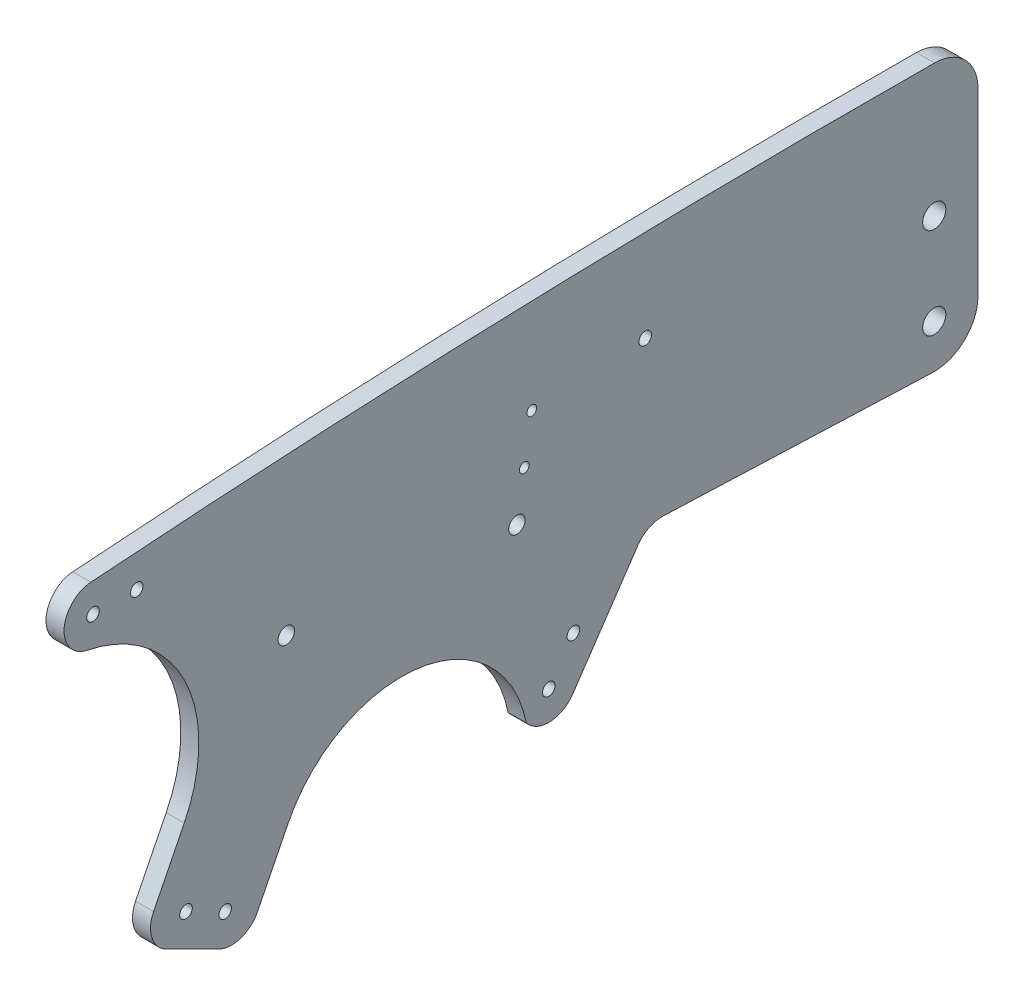
ISO-10303-21;
HEADER;
FILE_DESCRIPTION(('STEP AP214'),'2;1');
FILE_NAME('part.step','',(''),(''),'','','');
FILE_SCHEMA(('AUTOMOTIVE_DESIGN { 1 0 10303 214 1 1 1 1 }'));
ENDSEC;
DATA;
#1=APPLICATION_CONTEXT('core data for automotive mechanical design processes');
#2=APPLICATION_PROTOCOL_DEFINITION('international standard','automotive_design',2000,#1);
#3=PRODUCT_CONTEXT('',#1,'mechanical');
#4=PRODUCT('Part','Part','',(#3));
#5=PRODUCT_RELATED_PRODUCT_CATEGORY('part','',(#4));
#6=PRODUCT_DEFINITION_FORMATION('','',#4);
#7=PRODUCT_DEFINITION_CONTEXT('part definition',#1,'design');
#8=PRODUCT_DEFINITION('design','',#6,#7);
#9=PRODUCT_DEFINITION_SHAPE('','',#8);
#10=(LENGTH_UNIT() NAMED_UNIT(*) SI_UNIT(.MILLI.,.METRE.));
#11=(NAMED_UNIT(*) PLANE_ANGLE_UNIT() SI_UNIT($,.RADIAN.));
#12=(NAMED_UNIT(*) SI_UNIT($,.STERADIAN.) SOLID_ANGLE_UNIT());
#13=UNCERTAINTY_MEASURE_WITH_UNIT(LENGTH_MEASURE(1.E-05),#10,'distance_accuracy_value','');
#14=(GEOMETRIC_REPRESENTATION_CONTEXT(3) GLOBAL_UNCERTAINTY_ASSIGNED_CONTEXT((#13)) GLOBAL_UNIT_ASSIGNED_CONTEXT((#10,
#11,#12)) REPRESENTATION_CONTEXT('',''));
#15=CARTESIAN_POINT('',(0.,0.,0.));
#16=DIRECTION('',(0.,0.,1.));
#17=DIRECTION('',(1.,0.,0.));
#18=AXIS2_PLACEMENT_3D('',#15,#16,#17);
#19=CARTESIAN_POINT('',(4.953,-32.7611872371542,354.680554334521));
#20=DIRECTION('',(1.,0.,0.));
#21=DIRECTION('',(0.,0.,-1.));
#22=AXIS2_PLACEMENT_3D('',#19,#20,#21);
#23=PLANE('',#22);
#24=CARTESIAN_POINT('',(4.953,-53.2898683118976,485.252549027286));
#25=DIRECTION('',(1.,0.,0.));
#26=DIRECTION('',(0.,0.,-1.));
#27=AXIS2_PLACEMENT_3D('',#24,#25,#26);
#28=CIRCLE('',#27,1.72719999999997);
#29=CARTESIAN_POINT('',(4.953,-53.2898683118976,483.525349027286));
#30=VERTEX_POINT('',#29);
#31=EDGE_CURVE('E300',#30,#30,#28,.T.);
#32=ORIENTED_EDGE('',*,*,#31,.F.);
#33=EDGE_LOOP('',(#32));
#34=FACE_BOUND('',#33,.T.);
#35=CARTESIAN_POINT('',(4.953,29.9682270325283,498.771367049348));
#36=DIRECTION('',(1.,0.,0.));
#37=DIRECTION('',(0.,0.,-1.));
#38=AXIS2_PLACEMENT_3D('',#35,#36,#37);
#39=CIRCLE('',#38,1.72719999999997);
#40=CARTESIAN_POINT('',(4.953,29.9682270325283,497.044167049348));
#41=VERTEX_POINT('',#40);
#42=EDGE_CURVE('E294',#41,#41,#39,.T.);
#43=ORIENTED_EDGE('',*,*,#42,.F.);
#44=EDGE_LOOP('',(#43));
#45=FACE_BOUND('',#44,.T.);
#46=CARTESIAN_POINT('',(4.953,-40.2511356494511,379.006254083328));
#47=DIRECTION('',(1.,0.,0.));
#48=DIRECTION('',(0.,0.,-1.));
#49=AXIS2_PLACEMENT_3D('',#46,#47,#48);
#50=CIRCLE('',#49,1.72719999999999);
#51=CARTESIAN_POINT('',(4.953,-40.2511356494511,377.279054083328));
#52=VERTEX_POINT('',#51);
#53=EDGE_CURVE('E288',#52,#52,#50,.T.);
#54=ORIENTED_EDGE('',*,*,#53,.F.);
#55=EDGE_LOOP('',(#54));
#56=FACE_BOUND('',#55,.T.);
#57=CARTESIAN_POINT('',(4.953,-50.185658720557,385.737171654481));
#58=DIRECTION('',(1.,0.,0.));
#59=DIRECTION('',(0.,0.,-1.));
#60=AXIS2_PLACEMENT_3D('',#57,#58,#59);
#61=CIRCLE('',#60,1.72719999999997);
#62=CARTESIAN_POINT('',(4.953,-50.185658720557,384.009971654481));
#63=VERTEX_POINT('',#62);
#64=EDGE_CURVE('E282',#63,#63,#61,.T.);
#65=ORIENTED_EDGE('',*,*,#64,.F.);
#66=EDGE_LOOP('',(#65));
#67=FACE_BOUND('',#66,.T.);
#68=CARTESIAN_POINT('',(4.953,18.3061282263118,390.419716853028));
#69=DIRECTION('',(1.,0.,0.));
#70=DIRECTION('',(0.,0.,-1.));
#71=AXIS2_PLACEMENT_3D('',#68,#69,#70);
#72=CIRCLE('',#71,1.35255002158136);
#73=CARTESIAN_POINT('',(4.953,18.3061282263118,389.067166831447));
#74=VERTEX_POINT('',#73);
#75=EDGE_CURVE('E276',#74,#74,#72,.T.);
#76=ORIENTED_EDGE('',*,*,#75,.F.);
#77=EDGE_LOOP('',(#76));
#78=FACE_BOUND('',#77,.T.);
#79=CARTESIAN_POINT('',(4.953,-6.76719297354006,394.480328138154));
#80=DIRECTION('',(1.,0.,0.));
#81=DIRECTION('',(0.,0.,-1.));
#82=AXIS2_PLACEMENT_3D('',#79,#80,#81);
#83=CIRCLE('',#82,2.25424999999999);
#84=CARTESIAN_POINT('',(4.953,-6.76719297354006,392.226078138154));
#85=VERTEX_POINT('',#84);
#86=EDGE_CURVE('E210',#85,#85,#83,.T.);
#87=ORIENTED_EDGE('',*,*,#86,.F.);
#88=EDGE_LOOP('',(#87));
#89=FACE_BOUND('',#88,.T.);
#90=CARTESIAN_POINT('',(4.953,-32.7611872371542,354.680554334521));
#91=DIRECTION('',(-1.,0.,0.));
#92=DIRECTION('',(0.,0.,-1.));
#93=AXIS2_PLACEMENT_3D('',#90,#91,#92);
#94=CIRCLE('',#93,7.99999999999897);
#95=CARTESIAN_POINT('',(4.953,-28.2739088563857,361.303569715256));
#96=VERTEX_POINT('',#95);
#97=CARTESIAN_POINT('',(4.953,-24.7672215054673,354.369890721241));
#98=VERTEX_POINT('',#97);
#99=EDGE_CURVE('E211',#96,#98,#94,.T.);
#100=ORIENTED_EDGE('',*,*,#99,.T.);
#101=DIRECTION('',(0.,-0.0388329516596951,-0.999245716460869));
#102=VECTOR('',#101,1.);
#103=CARTESIAN_POINT('',(4.953,-24.7672215054673,354.369890721241));
#104=LINE('',#103,#102);
#105=CARTESIAN_POINT('',(4.953,-27.639294256366,280.465995419916));
#106=VERTEX_POINT('',#105);
#107=EDGE_CURVE('E122',#98,#106,#104,.T.);
#108=ORIENTED_EDGE('',*,*,#107,.T.);
#109=CARTESIAN_POINT('',(4.953,-15.6483456588356,280.));
#110=DIRECTION('',(1.,0.,0.));
#111=DIRECTION('',(0.,0.,1.));
#112=AXIS2_PLACEMENT_3D('',#109,#110,#111);
#113=CIRCLE('',#112,12.);
#114=CARTESIAN_POINT('',(4.953,-15.6483456588356,268.));
#115=VERTEX_POINT('',#114);
#116=EDGE_CURVE('E225',#106,#115,#113,.T.);
#117=ORIENTED_EDGE('',*,*,#116,.T.);
#118=DIRECTION('',(0.,1.,0.));
#119=VECTOR('',#118,1.);
#120=CARTESIAN_POINT('',(4.953,33.6380456938623,268.));
#121=LINE('',#120,#119);
#122=CARTESIAN_POINT('',(4.953,33.6380456938623,268.));
#123=VERTEX_POINT('',#122);
#124=EDGE_CURVE('E228',#115,#123,#121,.T.);
#125=ORIENTED_EDGE('',*,*,#124,.T.);
#126=CARTESIAN_POINT('',(4.953,33.6380456938623,280.));
#127=DIRECTION('',(1.,0.,0.));
#128=DIRECTION('',(0.,0.,-1.));
#129=AXIS2_PLACEMENT_3D('',#126,#127,#128);
#130=CIRCLE('',#129,12.0000000000002);
#131=CARTESIAN_POINT('',(4.953,45.6376789125345,279.906177735357));
#132=VERTEX_POINT('',#131);
#133=EDGE_CURVE('E232',#123,#132,#130,.T.);
#134=ORIENTED_EDGE('',*,*,#133,.T.);
#135=CARTESIAN_POINT('',(4.953,-2797.93492372453,302.139392400577));
#136=DIRECTION('',(1.,0.,0.));
#137=DIRECTION('',(0.,0.,1.));
#138=AXIS2_PLACEMENT_3D('',#135,#136,#137);
#139=CIRCLE('',#138,2843.65951940497);
#140=CARTESIAN_POINT('',(4.953,38.0179068856692,511.354604219596));
#141=VERTEX_POINT('',#140);
#142=EDGE_CURVE('E236',#132,#141,#139,.T.);
#143=ORIENTED_EDGE('',*,*,#142,.T.);
#144=CARTESIAN_POINT('',(4.953,30.1019185476259,510.770622300354));
#145=DIRECTION('',(1.,0.,0.));
#146=DIRECTION('',(0.,0.,-1.));
#147=AXIS2_PLACEMENT_3D('',#144,#145,#146);
#148=CIRCLE('',#147,7.93750000000252);
#149=CARTESIAN_POINT('',(4.953,22.31826474198,512.325819935349));
#150=VERTEX_POINT('',#149);
#151=EDGE_CURVE('E244',#141,#150,#148,.T.);
#152=ORIENTED_EDGE('',*,*,#151,.T.);
#153=CARTESIAN_POINT('',(4.953,-15.0065003575197,519.783421192923));
#154=DIRECTION('',(-1.,0.,0.));
#155=DIRECTION('',(0.,0.,-1.));
#156=AXIS2_PLACEMENT_3D('',#153,#154,#155);
#157=CIRCLE('',#156,38.0624999999975);
#158=CARTESIAN_POINT('',(4.953,-32.0249578675477,485.73748149038));
#159=VERTEX_POINT('',#158);
#160=EDGE_CURVE('E247',#150,#159,#157,.T.);
#161=ORIENTED_EDGE('',*,*,#160,.T.);
#162=DIRECTION('',(0.,-0.894474606306604,0.447118752316033));
#163=VECTOR('',#162,1.);
#164=CARTESIAN_POINT('',(4.953,-32.0249578675479,485.73748149038));
#165=LINE('',#164,#163);
#166=CARTESIAN_POINT('',(4.953,-48.8447478119963,494.145147220805));
#167=VERTEX_POINT('',#166);
#168=EDGE_CURVE('E251',#159,#167,#165,.T.);
#169=ORIENTED_EDGE('',*,*,#168,.T.);
#170=CARTESIAN_POINT('',(4.953,-52.4216978305244,486.989350370353));
#171=DIRECTION('',(1.,0.,0.));
#172=DIRECTION('',(0.,0.,-1.));
#173=AXIS2_PLACEMENT_3D('',#170,#171,#172);
#174=CIRCLE('',#173,7.99999999999946);
#175=CARTESIAN_POINT('',(4.953,-59.5774946809771,490.566300388881));
#176=VERTEX_POINT('',#175);
#177=EDGE_CURVE('E255',#167,#176,#174,.T.);
#178=ORIENTED_EDGE('',*,*,#177,.T.);
#179=DIRECTION('',(0.,-0.447118752316036,-0.894474606306602));
#180=VECTOR('',#179,1.);
#181=CARTESIAN_POINT('',(4.953,-59.5774946809774,490.566300388881));
#182=LINE('',#181,#180);
#183=CARTESIAN_POINT('',(4.953,-66.6792606715157,476.359002427067));
#184=VERTEX_POINT('',#183);
#185=EDGE_CURVE('E262',#176,#184,#182,.T.);
#186=ORIENTED_EDGE('',*,*,#185,.T.);
#187=CARTESIAN_POINT('',(4.953,-59.5234638210631,472.782052408539));
#188=DIRECTION('',(1.,0.,0.));
#189=DIRECTION('',(0.,0.,-1.));
#190=AXIS2_PLACEMENT_3D('',#187,#188,#189);
#191=CIRCLE('',#190,7.99999999999985);
#192=CARTESIAN_POINT('',(4.953,-63.1004138395911,465.626255558086));
#193=VERTEX_POINT('',#192);
#194=EDGE_CURVE('E265',#184,#193,#191,.T.);
#195=ORIENTED_EDGE('',*,*,#194,.T.);
#196=DIRECTION('',(0.,0.894474606306604,-0.447118752316034));
#197=VECTOR('',#196,1.);
#198=CARTESIAN_POINT('',(4.953,-63.1004138395911,465.626255558086));
#199=LINE('',#198,#197);
#200=CARTESIAN_POINT('',(4.953,-46.2806238951434,457.218589827661));
#201=VERTEX_POINT('',#200);
#202=EDGE_CURVE('E165',#193,#201,#199,.T.);
#203=ORIENTED_EDGE('',*,*,#202,.T.);
#204=CARTESIAN_POINT('',(4.953,-61.8421896626251,426.087206182307));
#205=DIRECTION('',(-1.,0.,0.));
#206=DIRECTION('',(0.,0.,-1.));
#207=AXIS2_PLACEMENT_3D('',#204,#205,#206);
#208=CIRCLE('',#207,34.8040999999982);
#209=CARTESIAN_POINT('',(4.953,-55.1468529615088,391.933175040016));
#210=VERTEX_POINT('',#209);
#211=EDGE_CURVE('E159',#201,#210,#208,.T.);
#212=ORIENTED_EDGE('',*,*,#211,.T.);
#213=CARTESIAN_POINT('',(4.953,-50.185658720557,385.737171654481));
#214=DIRECTION('',(1.,0.,0.));
#215=DIRECTION('',(0.,0.,-1.));
#216=AXIS2_PLACEMENT_3D('',#213,#214,#215);
#217=CIRCLE('',#216,7.93750000000079);
#218=CARTESIAN_POINT('',(4.953,-54.6378802389763,379.165898581405));
#219=VERTEX_POINT('',#218);
#220=EDGE_CURVE('E163',#210,#219,#217,.T.);
#221=ORIENTED_EDGE('',*,*,#220,.T.);
#222=DIRECTION('',(0.,0.827876922592201,-0.560909797596073));
#223=VECTOR('',#222,1.);
#224=CARTESIAN_POINT('',(4.953,-54.6378802389763,379.165898581405));
#225=LINE('',#224,#223);
#226=EDGE_CURVE('E55',#219,#96,#225,.T.);
#227=ORIENTED_EDGE('',*,*,#226,.T.);
#228=EDGE_LOOP('',(#100,#108,#117,#125,#134,#143,#152,#161,#169,#178,#186,#195,#203,#212,#221,#227));
#229=FACE_BOUND('',#228,.T.);
#230=CARTESIAN_POINT('',(4.953,-1.41718755012804,457.754552289623));
#231=DIRECTION('',(1.,0.,0.));
#232=DIRECTION('',(0.,0.,-1.));
#233=AXIS2_PLACEMENT_3D('',#230,#231,#232);
#234=CIRCLE('',#233,2.25424999999999);
#235=CARTESIAN_POINT('',(4.953,-1.41718755012804,455.500302289623));
#236=VERTEX_POINT('',#235);
#237=EDGE_CURVE('E198',#236,#236,#234,.T.);
#238=ORIENTED_EDGE('',*,*,#237,.F.);
#239=EDGE_LOOP('',(#238));
#240=FACE_BOUND('',#239,.T.);
#241=CARTESIAN_POINT('',(4.953,30.1019185476259,510.770622300354));
#242=DIRECTION('',(1.,0.,0.));
#243=DIRECTION('',(0.,0.,-1.));
#244=AXIS2_PLACEMENT_3D('',#241,#242,#243);
#245=CIRCLE('',#244,1.72720000000008);
#246=CARTESIAN_POINT('',(4.953,30.1019185476259,509.043422300354));
#247=VERTEX_POINT('',#246);
#248=EDGE_CURVE('E611',#247,#247,#245,.T.);
#249=ORIENTED_EDGE('',*,*,#248,.F.);
#250=EDGE_LOOP('',(#249));
#251=FACE_BOUND('',#250,.T.);
#252=CARTESIAN_POINT('',(4.953,5.76946762638475,392.450022495594));
#253=DIRECTION('',(1.,0.,0.));
#254=DIRECTION('',(0.,0.,-1.));
#255=AXIS2_PLACEMENT_3D('',#252,#253,#254);
#256=CIRCLE('',#255,1.35255002158135);
#257=CARTESIAN_POINT('',(4.953,5.76946762638475,391.097472474013));
#258=VERTEX_POINT('',#257);
#259=EDGE_CURVE('E610',#258,#258,#256,.T.);
#260=ORIENTED_EDGE('',*,*,#259,.F.);
#261=EDGE_LOOP('',(#260));
#262=FACE_BOUND('',#261,.T.);
#263=CARTESIAN_POINT('',(4.953,-15.6483456588356,280.));
#264=DIRECTION('',(1.,0.,0.));
#265=DIRECTION('',(0.,0.,-1.));
#266=AXIS2_PLACEMENT_3D('',#263,#264,#265);
#267=CIRCLE('',#266,3.17499999999997);
#268=CARTESIAN_POINT('',(4.953,-15.6483456588356,276.825));
#269=VERTEX_POINT('',#268);
#270=EDGE_CURVE('E599',#269,#269,#267,.T.);
#271=ORIENTED_EDGE('',*,*,#270,.F.);
#272=EDGE_LOOP('',(#271));
#273=FACE_BOUND('',#272,.T.);
#274=CARTESIAN_POINT('',(4.953,19.9282164771804,359.276554144292));
#275=DIRECTION('',(1.,0.,0.));
#276=DIRECTION('',(0.,0.,-1.));
#277=AXIS2_PLACEMENT_3D('',#274,#275,#276);
#278=CIRCLE('',#277,1.72719999999997);
#279=CARTESIAN_POINT('',(4.953,19.9282164771804,357.549354144292));
#280=VERTEX_POINT('',#279);
#281=EDGE_CURVE('E325',#280,#280,#278,.T.);
#282=ORIENTED_EDGE('',*,*,#281,.F.);
#283=EDGE_LOOP('',(#282));
#284=FACE_BOUND('',#283,.T.);
#285=CARTESIAN_POINT('',(4.953,-58.65529333969,474.518853751606));
#286=DIRECTION('',(1.,0.,0.));
#287=DIRECTION('',(0.,0.,-1.));
#288=AXIS2_PLACEMENT_3D('',#285,#286,#287);
#289=CIRCLE('',#288,1.72719999999997);
#290=CARTESIAN_POINT('',(4.953,-58.65529333969,472.791653751606));
#291=VERTEX_POINT('',#290);
#292=EDGE_CURVE('E308',#291,#291,#289,.T.);
#293=ORIENTED_EDGE('',*,*,#292,.F.);
#294=EDGE_LOOP('',(#293));
#295=FACE_BOUND('',#294,.T.);
#296=CARTESIAN_POINT('',(4.953,9.35165434116442,280.));
#297=DIRECTION('',(1.,0.,0.));
#298=DIRECTION('',(0.,0.,-1.));
#299=AXIS2_PLACEMENT_3D('',#296,#297,#298);
#300=CIRCLE('',#299,3.17499999999997);
#301=CARTESIAN_POINT('',(4.953,9.35165434116442,276.825));
#302=VERTEX_POINT('',#301);
#303=EDGE_CURVE('E311',#302,#302,#300,.T.);
#304=ORIENTED_EDGE('',*,*,#303,.F.);
#305=EDGE_LOOP('',(#304));
#306=FACE_BOUND('',#305,.T.);
#307=ADVANCED_FACE('F38',(#34,#45,#56,#67,#78,#89,#229,#240,#251,#262,#273,#284,#295,#306),#23,.T.);
#308=CARTESIAN_POINT('',(0.,-32.7611872371542,354.680554334521));
#309=DIRECTION('',(1.,0.,0.));
#310=DIRECTION('',(0.,0.,-1.));
#311=AXIS2_PLACEMENT_3D('',#308,#309,#310);
#312=PLANE('',#311);
#313=CARTESIAN_POINT('',(0.,-32.7611872371542,354.680554334521));
#314=DIRECTION('',(-1.,0.,0.));
#315=DIRECTION('',(0.,0.,-1.));
#316=AXIS2_PLACEMENT_3D('',#313,#314,#315);
#317=CIRCLE('',#316,7.99999999999897);
#318=CARTESIAN_POINT('',(0.,-28.2739088563857,361.303569715256));
#319=VERTEX_POINT('',#318);
#320=CARTESIAN_POINT('',(0.,-24.7672215054673,354.369890721241));
#321=VERTEX_POINT('',#320);
#322=EDGE_CURVE('E204',#319,#321,#317,.T.);
#323=ORIENTED_EDGE('',*,*,#322,.F.);
#324=DIRECTION('',(0.,0.827876922592201,-0.560909797596073));
#325=VECTOR('',#324,1.);
#326=CARTESIAN_POINT('',(0.,-54.6378802389763,379.165898581405));
#327=LINE('',#326,#325);
#328=CARTESIAN_POINT('',(0.,-54.6378802389763,379.165898581405));
#329=VERTEX_POINT('',#328);
#330=EDGE_CURVE('E114',#329,#319,#327,.T.);
#331=ORIENTED_EDGE('',*,*,#330,.F.);
#332=CARTESIAN_POINT('',(0.,-50.185658720557,385.737171654481));
#333=DIRECTION('',(1.,0.,0.));
#334=DIRECTION('',(0.,0.,-1.));
#335=AXIS2_PLACEMENT_3D('',#332,#333,#334);
#336=CIRCLE('',#335,7.93750000000079);
#337=CARTESIAN_POINT('',(0.,-55.1468529615088,391.933175040016));
#338=VERTEX_POINT('',#337);
#339=EDGE_CURVE('E108',#338,#329,#336,.T.);
#340=ORIENTED_EDGE('',*,*,#339,.F.);
#341=CARTESIAN_POINT('',(0.,-61.8421896626251,426.087206182307));
#342=DIRECTION('',(-1.,0.,0.));
#343=DIRECTION('',(0.,0.,-1.));
#344=AXIS2_PLACEMENT_3D('',#341,#342,#343);
#345=CIRCLE('',#344,34.8040999999982);
#346=CARTESIAN_POINT('',(0.,-46.2806238951434,457.218589827661));
#347=VERTEX_POINT('',#346);
#348=EDGE_CURVE('E174',#347,#338,#345,.T.);
#349=ORIENTED_EDGE('',*,*,#348,.F.);
#350=DIRECTION('',(0.,0.894474606306604,-0.447118752316034));
#351=VECTOR('',#350,1.);
#352=CARTESIAN_POINT('',(0.,-63.1004138395911,465.626255558086));
#353=LINE('',#352,#351);
#354=CARTESIAN_POINT('',(0.,-63.1004138395911,465.626255558086));
#355=VERTEX_POINT('',#354);
#356=EDGE_CURVE('E500',#355,#347,#353,.T.);
#357=ORIENTED_EDGE('',*,*,#356,.F.);
#358=CARTESIAN_POINT('',(0.,-59.5234638210631,472.782052408539));
#359=DIRECTION('',(1.,0.,0.));
#360=DIRECTION('',(0.,0.,-1.));
#361=AXIS2_PLACEMENT_3D('',#358,#359,#360);
#362=CIRCLE('',#361,7.99999999999985);
#363=CARTESIAN_POINT('',(0.,-66.6792606715157,476.359002427067));
#364=VERTEX_POINT('',#363);
#365=EDGE_CURVE('E498',#364,#355,#362,.T.);
#366=ORIENTED_EDGE('',*,*,#365,.F.);
#367=DIRECTION('',(0.,-0.447118752316036,-0.894474606306602));
#368=VECTOR('',#367,1.);
#369=CARTESIAN_POINT('',(0.,-59.5774946809774,490.566300388881));
#370=LINE('',#369,#368);
#371=CARTESIAN_POINT('',(0.,-59.5774946809771,490.566300388881));
#372=VERTEX_POINT('',#371);
#373=EDGE_CURVE('E496',#372,#364,#370,.T.);
#374=ORIENTED_EDGE('',*,*,#373,.F.);
#375=CARTESIAN_POINT('',(0.,-52.4216978305244,486.989350370353));
#376=DIRECTION('',(1.,0.,0.));
#377=DIRECTION('',(0.,0.,-1.));
#378=AXIS2_PLACEMENT_3D('',#375,#376,#377);
#379=CIRCLE('',#378,7.99999999999946);
#380=CARTESIAN_POINT('',(0.,-48.8447478119963,494.145147220805));
#381=VERTEX_POINT('',#380);
#382=EDGE_CURVE('E494',#381,#372,#379,.T.);
#383=ORIENTED_EDGE('',*,*,#382,.F.);
#384=DIRECTION('',(0.,-0.894474606306604,0.447118752316033));
#385=VECTOR('',#384,1.);
#386=CARTESIAN_POINT('',(0.,-32.0249578675479,485.73748149038));
#387=LINE('',#386,#385);
#388=CARTESIAN_POINT('',(0.,-32.0249578675477,485.73748149038));
#389=VERTEX_POINT('',#388);
#390=EDGE_CURVE('E492',#389,#381,#387,.T.);
#391=ORIENTED_EDGE('',*,*,#390,.F.);
#392=CARTESIAN_POINT('',(0.,-15.0065003575197,519.783421192923));
#393=DIRECTION('',(-1.,0.,0.));
#394=DIRECTION('',(0.,0.,-1.));
#395=AXIS2_PLACEMENT_3D('',#392,#393,#394);
#396=CIRCLE('',#395,38.0624999999975);
#397=CARTESIAN_POINT('',(0.,22.31826474198,512.325819935349));
#398=VERTEX_POINT('',#397);
#399=EDGE_CURVE('E490',#398,#389,#396,.T.);
#400=ORIENTED_EDGE('',*,*,#399,.F.);
#401=CARTESIAN_POINT('',(0.,30.1019185476259,510.770622300354));
#402=DIRECTION('',(1.,0.,0.));
#403=DIRECTION('',(0.,0.,-1.));
#404=AXIS2_PLACEMENT_3D('',#401,#402,#403);
#405=CIRCLE('',#404,7.93750000000252);
#406=CARTESIAN_POINT('',(0.,38.0179068856692,511.354604219596));
#407=VERTEX_POINT('',#406);
#408=EDGE_CURVE('E488',#407,#398,#405,.T.);
#409=ORIENTED_EDGE('',*,*,#408,.F.);
#410=CARTESIAN_POINT('',(0.,-2797.93492372453,302.139392400577));
#411=DIRECTION('',(1.,0.,0.));
#412=DIRECTION('',(0.,0.,1.));
#413=AXIS2_PLACEMENT_3D('',#410,#411,#412);
#414=CIRCLE('',#413,2843.65951940497);
#415=CARTESIAN_POINT('',(0.,45.6376789125345,279.906177735357));
#416=VERTEX_POINT('',#415);
#417=EDGE_CURVE('E486',#416,#407,#414,.T.);
#418=ORIENTED_EDGE('',*,*,#417,.F.);
#419=CARTESIAN_POINT('',(0.,33.6380456938623,280.));
#420=DIRECTION('',(1.,0.,0.));
#421=DIRECTION('',(0.,0.,-1.));
#422=AXIS2_PLACEMENT_3D('',#419,#420,#421);
#423=CIRCLE('',#422,12.0000000000002);
#424=CARTESIAN_POINT('',(0.,33.6380456938623,268.));
#425=VERTEX_POINT('',#424);
#426=EDGE_CURVE('E482',#425,#416,#423,.T.);
#427=ORIENTED_EDGE('',*,*,#426,.F.);
#428=DIRECTION('',(0.,1.,0.));
#429=VECTOR('',#428,1.);
#430=CARTESIAN_POINT('',(0.,33.6380456938623,268.));
#431=LINE('',#430,#429);
#432=CARTESIAN_POINT('',(0.,-15.6483456588356,268.));
#433=VERTEX_POINT('',#432);
#434=EDGE_CURVE('E480',#433,#425,#431,.T.);
#435=ORIENTED_EDGE('',*,*,#434,.F.);
#436=CARTESIAN_POINT('',(0.,-15.6483456588356,280.));
#437=DIRECTION('',(1.,0.,0.));
#438=DIRECTION('',(0.,0.,1.));
#439=AXIS2_PLACEMENT_3D('',#436,#437,#438);
#440=CIRCLE('',#439,12.);
#441=CARTESIAN_POINT('',(0.,-27.639294256366,280.465995419916));
#442=VERTEX_POINT('',#441);
#443=EDGE_CURVE('E472',#442,#433,#440,.T.);
#444=ORIENTED_EDGE('',*,*,#443,.F.);
#445=DIRECTION('',(0.,-0.0388329516596951,-0.999245716460869));
#446=VECTOR('',#445,1.);
#447=CARTESIAN_POINT('',(0.,-24.7672215054673,354.369890721241));
#448=LINE('',#447,#446);
#449=EDGE_CURVE('E465',#321,#442,#448,.T.);
#450=ORIENTED_EDGE('',*,*,#449,.F.);
#451=EDGE_LOOP('',(#323,#331,#340,#349,#357,#366,#374,#383,#391,#400,#409,#418,#427,#435,#444,#450));
#452=FACE_BOUND('',#451,.T.);
#453=CARTESIAN_POINT('',(0.,-1.41718755012804,457.754552289623));
#454=DIRECTION('',(1.,0.,0.));
#455=DIRECTION('',(0.,0.,-1.));
#456=AXIS2_PLACEMENT_3D('',#453,#454,#455);
#457=CIRCLE('',#456,2.25424999999999);
#458=CARTESIAN_POINT('',(0.,-1.41718755012804,455.500302289623));
#459=VERTEX_POINT('',#458);
#460=EDGE_CURVE('E205',#459,#459,#457,.T.);
#461=ORIENTED_EDGE('',*,*,#460,.T.);
#462=EDGE_LOOP('',(#461));
#463=FACE_BOUND('',#462,.T.);
#464=CARTESIAN_POINT('',(0.,-6.76719297354006,394.480328138154));
#465=DIRECTION('',(1.,0.,0.));
#466=DIRECTION('',(0.,0.,-1.));
#467=AXIS2_PLACEMENT_3D('',#464,#465,#466);
#468=CIRCLE('',#467,2.25424999999999);
#469=CARTESIAN_POINT('',(0.,-6.76719297354006,392.226078138154));
#470=VERTEX_POINT('',#469);
#471=EDGE_CURVE('E206',#470,#470,#468,.T.);
#472=ORIENTED_EDGE('',*,*,#471,.T.);
#473=EDGE_LOOP('',(#472));
#474=FACE_BOUND('',#473,.T.);
#475=CARTESIAN_POINT('',(0.,30.1019185476259,510.770622300354));
#476=DIRECTION('',(1.,0.,0.));
#477=DIRECTION('',(0.,0.,-1.));
#478=AXIS2_PLACEMENT_3D('',#475,#476,#477);
#479=CIRCLE('',#478,1.72720000000008);
#480=CARTESIAN_POINT('',(0.,30.1019185476259,509.043422300354));
#481=VERTEX_POINT('',#480);
#482=EDGE_CURVE('E279',#481,#481,#479,.T.);
#483=ORIENTED_EDGE('',*,*,#482,.T.);
#484=EDGE_LOOP('',(#483));
#485=FACE_BOUND('',#484,.T.);
#486=CARTESIAN_POINT('',(0.,18.3061282263118,390.419716853028));
#487=DIRECTION('',(1.,0.,0.));
#488=DIRECTION('',(0.,0.,-1.));
#489=AXIS2_PLACEMENT_3D('',#486,#487,#488);
#490=CIRCLE('',#489,1.35255002158136);
#491=CARTESIAN_POINT('',(0.,18.3061282263118,389.067166831447));
#492=VERTEX_POINT('',#491);
#493=EDGE_CURVE('E280',#492,#492,#490,.T.);
#494=ORIENTED_EDGE('',*,*,#493,.T.);
#495=EDGE_LOOP('',(#494));
#496=FACE_BOUND('',#495,.T.);
#497=CARTESIAN_POINT('',(0.,5.76946762638475,392.450022495594));
#498=DIRECTION('',(1.,0.,0.));
#499=DIRECTION('',(0.,0.,-1.));
#500=AXIS2_PLACEMENT_3D('',#497,#498,#499);
#501=CIRCLE('',#500,1.35255002158135);
#502=CARTESIAN_POINT('',(0.,5.76946762638475,391.097472474013));
#503=VERTEX_POINT('',#502);
#504=EDGE_CURVE('E285',#503,#503,#501,.T.);
#505=ORIENTED_EDGE('',*,*,#504,.T.);
#506=EDGE_LOOP('',(#505));
#507=FACE_BOUND('',#506,.T.);
#508=CARTESIAN_POINT('',(0.,-50.185658720557,385.737171654481));
#509=DIRECTION('',(1.,0.,0.));
#510=DIRECTION('',(0.,0.,-1.));
#511=AXIS2_PLACEMENT_3D('',#508,#509,#510);
#512=CIRCLE('',#511,1.72719999999997);
#513=CARTESIAN_POINT('',(0.,-50.185658720557,384.009971654481));
#514=VERTEX_POINT('',#513);
#515=EDGE_CURVE('E286',#514,#514,#512,.T.);
#516=ORIENTED_EDGE('',*,*,#515,.T.);
#517=EDGE_LOOP('',(#516));
#518=FACE_BOUND('',#517,.T.);
#519=CARTESIAN_POINT('',(0.,-15.6483456588356,280.));
#520=DIRECTION('',(1.,0.,0.));
#521=DIRECTION('',(0.,0.,-1.));
#522=AXIS2_PLACEMENT_3D('',#519,#520,#521);
#523=CIRCLE('',#522,3.17499999999997);
#524=CARTESIAN_POINT('',(0.,-15.6483456588356,276.825));
#525=VERTEX_POINT('',#524);
#526=EDGE_CURVE('E291',#525,#525,#523,.T.);
#527=ORIENTED_EDGE('',*,*,#526,.T.);
#528=EDGE_LOOP('',(#527));
#529=FACE_BOUND('',#528,.T.);
#530=CARTESIAN_POINT('',(0.,-40.2511356494511,379.006254083328));
#531=DIRECTION('',(1.,0.,0.));
#532=DIRECTION('',(0.,0.,-1.));
#533=AXIS2_PLACEMENT_3D('',#530,#531,#532);
#534=CIRCLE('',#533,1.72719999999999);
#535=CARTESIAN_POINT('',(0.,-40.2511356494511,377.279054083328));
#536=VERTEX_POINT('',#535);
#537=EDGE_CURVE('E292',#536,#536,#534,.T.);
#538=ORIENTED_EDGE('',*,*,#537,.T.);
#539=EDGE_LOOP('',(#538));
#540=FACE_BOUND('',#539,.T.);
#541=CARTESIAN_POINT('',(0.,19.9282164771804,359.276554144292));
#542=DIRECTION('',(1.,0.,0.));
#543=DIRECTION('',(0.,0.,-1.));
#544=AXIS2_PLACEMENT_3D('',#541,#542,#543);
#545=CIRCLE('',#544,1.72719999999997);
#546=CARTESIAN_POINT('',(0.,19.9282164771804,357.549354144292));
#547=VERTEX_POINT('',#546);
#548=EDGE_CURVE('E297',#547,#547,#545,.T.);
#549=ORIENTED_EDGE('',*,*,#548,.T.);
#550=EDGE_LOOP('',(#549));
#551=FACE_BOUND('',#550,.T.);
#552=CARTESIAN_POINT('',(0.,29.9682270325283,498.771367049348));
#553=DIRECTION('',(1.,0.,0.));
#554=DIRECTION('',(0.,0.,-1.));
#555=AXIS2_PLACEMENT_3D('',#552,#553,#554);
#556=CIRCLE('',#555,1.72719999999997);
#557=CARTESIAN_POINT('',(0.,29.9682270325283,497.044167049348));
#558=VERTEX_POINT('',#557);
#559=EDGE_CURVE('E298',#558,#558,#556,.T.);
#560=ORIENTED_EDGE('',*,*,#559,.T.);
#561=EDGE_LOOP('',(#560));
#562=FACE_BOUND('',#561,.T.);
#563=CARTESIAN_POINT('',(0.,-58.65529333969,474.518853751606));
#564=DIRECTION('',(1.,0.,0.));
#565=DIRECTION('',(0.,0.,-1.));
#566=AXIS2_PLACEMENT_3D('',#563,#564,#565);
#567=CIRCLE('',#566,1.72719999999997);
#568=CARTESIAN_POINT('',(0.,-58.65529333969,472.791653751606));
#569=VERTEX_POINT('',#568);
#570=EDGE_CURVE('E302',#569,#569,#567,.T.);
#571=ORIENTED_EDGE('',*,*,#570,.T.);
#572=EDGE_LOOP('',(#571));
#573=FACE_BOUND('',#572,.T.);
#574=CARTESIAN_POINT('',(0.,-53.2898683118976,485.252549027286));
#575=DIRECTION('',(1.,0.,0.));
#576=DIRECTION('',(0.,0.,-1.));
#577=AXIS2_PLACEMENT_3D('',#574,#575,#576);
#578=CIRCLE('',#577,1.72719999999997);
#579=CARTESIAN_POINT('',(0.,-53.2898683118976,483.525349027286));
#580=VERTEX_POINT('',#579);
#581=EDGE_CURVE('E303',#580,#580,#578,.T.);
#582=ORIENTED_EDGE('',*,*,#581,.T.);
#583=EDGE_LOOP('',(#582));
#584=FACE_BOUND('',#583,.T.);
#585=CARTESIAN_POINT('',(0.,9.35165434116442,280.));
#586=DIRECTION('',(1.,0.,0.));
#587=DIRECTION('',(0.,0.,-1.));
#588=AXIS2_PLACEMENT_3D('',#585,#586,#587);
#589=CIRCLE('',#588,3.17499999999997);
#590=CARTESIAN_POINT('',(0.,9.35165434116442,276.825));
#591=VERTEX_POINT('',#590);
#592=EDGE_CURVE('E315',#591,#591,#589,.T.);
#593=ORIENTED_EDGE('',*,*,#592,.T.);
#594=EDGE_LOOP('',(#593));
#595=FACE_BOUND('',#594,.T.);
#596=ADVANCED_FACE('F344',(#452,#463,#474,#485,#496,#507,#518,#529,#540,#551,#562,#573,#584,
#595),#312,.F.);
#597=CARTESIAN_POINT('',(4.953,-32.7611872371542,354.680554334521));
#598=DIRECTION('',(-1.,0.,0.));
#599=DIRECTION('',(0.,0.,1.));
#600=AXIS2_PLACEMENT_3D('',#597,#598,#599);
#601=CYLINDRICAL_SURFACE('',#600,7.99999999999897);
#602=ORIENTED_EDGE('',*,*,#322,.T.);
#603=DIRECTION('',(-1.,0.,0.));
#604=VECTOR('',#603,1.);
#605=CARTESIAN_POINT('',(4.953,-24.7672215054673,354.369890721241));
#606=LINE('',#605,#604);
#607=EDGE_CURVE('E12',#98,#321,#606,.T.);
#608=ORIENTED_EDGE('',*,*,#607,.F.);
#609=ORIENTED_EDGE('',*,*,#99,.F.);
#610=DIRECTION('',(-1.,0.,0.));
#611=VECTOR('',#610,1.);
#612=CARTESIAN_POINT('',(4.953,-28.2739088563857,361.303569715256));
#613=LINE('',#612,#611);
#614=EDGE_CURVE('E182',#96,#319,#613,.T.);
#615=ORIENTED_EDGE('',*,*,#614,.T.);
#616=EDGE_LOOP('',(#602,#608,#609,#615));
#617=FACE_BOUND('',#616,.T.);
#618=ADVANCED_FACE('F40',(#617),#601,.F.);
#619=CARTESIAN_POINT('',(4.953,-24.7672215054673,354.369890721241));
#620=DIRECTION('',(0.,0.999245716460869,-0.0388329516596951));
#621=DIRECTION('',(0.,0.0388329516596951,0.999245716460869));
#622=AXIS2_PLACEMENT_3D('',#619,#620,#621);
#623=PLANE('',#622);
#624=ORIENTED_EDGE('',*,*,#449,.T.);
#625=DIRECTION('',(-1.,0.,0.));
#626=VECTOR('',#625,1.);
#627=CARTESIAN_POINT('',(4.953,-27.639294256366,280.465995419916));
#628=LINE('',#627,#626);
#629=EDGE_CURVE('E47',#106,#442,#628,.T.);
#630=ORIENTED_EDGE('',*,*,#629,.F.);
#631=ORIENTED_EDGE('',*,*,#107,.F.);
#632=ORIENTED_EDGE('',*,*,#607,.T.);
#633=EDGE_LOOP('',(#624,#630,#631,#632));
#634=FACE_BOUND('',#633,.T.);
#635=ADVANCED_FACE('F458',(#634),#623,.F.);
#636=CARTESIAN_POINT('',(4.953,-15.6483456588356,280.));
#637=DIRECTION('',(-1.,0.,0.));
#638=DIRECTION('',(0.,0.,1.));
#639=AXIS2_PLACEMENT_3D('',#636,#637,#638);
#640=CYLINDRICAL_SURFACE('',#639,12.);
#641=ORIENTED_EDGE('',*,*,#443,.T.);
#642=DIRECTION('',(-1.,0.,0.));
#643=VECTOR('',#642,1.);
#644=CARTESIAN_POINT('',(4.953,-15.6483456588356,268.));
#645=LINE('',#644,#643);
#646=EDGE_CURVE('E476',#115,#433,#645,.T.);
#647=ORIENTED_EDGE('',*,*,#646,.F.);
#648=ORIENTED_EDGE('',*,*,#116,.F.);
#649=ORIENTED_EDGE('',*,*,#629,.T.);
#650=EDGE_LOOP('',(#641,#647,#648,#649));
#651=FACE_BOUND('',#650,.T.);
#652=ADVANCED_FACE('F455',(#651),#640,.T.);
#653=CARTESIAN_POINT('',(4.953,33.6380456938623,268.));
#654=DIRECTION('',(0.,0.,1.));
#655=DIRECTION('',(0.,-1.,0.));
#656=AXIS2_PLACEMENT_3D('',#653,#654,#655);
#657=PLANE('',#656);
#658=ORIENTED_EDGE('',*,*,#434,.T.);
#659=DIRECTION('',(-1.,0.,0.));
#660=VECTOR('',#659,1.);
#661=CARTESIAN_POINT('',(4.953,33.6380456938623,268.));
#662=LINE('',#661,#660);
#663=EDGE_CURVE('E532',#123,#425,#662,.T.);
#664=ORIENTED_EDGE('',*,*,#663,.F.);
#665=ORIENTED_EDGE('',*,*,#124,.F.);
#666=ORIENTED_EDGE('',*,*,#646,.T.);
#667=EDGE_LOOP('',(#658,#664,#665,#666));
#668=FACE_BOUND('',#667,.T.);
#669=ADVANCED_FACE('F451',(#668),#657,.F.);
#670=CARTESIAN_POINT('',(4.953,33.6380456938623,280.));
#671=DIRECTION('',(-1.,0.,0.));
#672=DIRECTION('',(0.,0.,1.));
#673=AXIS2_PLACEMENT_3D('',#670,#671,#672);
#674=CYLINDRICAL_SURFACE('',#673,12.0000000000002);
#675=ORIENTED_EDGE('',*,*,#426,.T.);
#676=DIRECTION('',(-1.,0.,0.));
#677=VECTOR('',#676,1.);
#678=CARTESIAN_POINT('',(4.953,45.6376789125345,279.906177735357));
#679=LINE('',#678,#677);
#680=EDGE_CURVE('E529',#132,#416,#679,.T.);
#681=ORIENTED_EDGE('',*,*,#680,.F.);
#682=ORIENTED_EDGE('',*,*,#133,.F.);
#683=ORIENTED_EDGE('',*,*,#663,.T.);
#684=EDGE_LOOP('',(#675,#681,#682,#683));
#685=FACE_BOUND('',#684,.T.);
#686=ADVANCED_FACE('F447',(#685),#674,.T.);
#687=CARTESIAN_POINT('',(4.953,-2797.93492372453,302.139392400577));
#688=DIRECTION('',(-1.,0.,0.));
#689=DIRECTION('',(0.,0.,1.));
#690=AXIS2_PLACEMENT_3D('',#687,#688,#689);
#691=CYLINDRICAL_SURFACE('',#690,2843.65951940497);
#692=ORIENTED_EDGE('',*,*,#417,.T.);
#693=DIRECTION('',(-1.,0.,0.));
#694=VECTOR('',#693,1.);
#695=CARTESIAN_POINT('',(4.953,38.0179068856692,511.354604219596));
#696=LINE('',#695,#694);
#697=EDGE_CURVE('E526',#141,#407,#696,.T.);
#698=ORIENTED_EDGE('',*,*,#697,.F.);
#699=ORIENTED_EDGE('',*,*,#142,.F.);
#700=ORIENTED_EDGE('',*,*,#680,.T.);
#701=EDGE_LOOP('',(#692,#698,#699,#700));
#702=FACE_BOUND('',#701,.T.);
#703=ADVANCED_FACE('F443',(#702),#691,.T.);
#704=CARTESIAN_POINT('',(4.953,30.1019185476259,510.770622300354));
#705=DIRECTION('',(-1.,0.,0.));
#706=DIRECTION('',(0.,0.,1.));
#707=AXIS2_PLACEMENT_3D('',#704,#705,#706);
#708=CYLINDRICAL_SURFACE('',#707,7.93750000000252);
#709=ORIENTED_EDGE('',*,*,#408,.T.);
#710=DIRECTION('',(-1.,0.,0.));
#711=VECTOR('',#710,1.);
#712=CARTESIAN_POINT('',(4.953,22.31826474198,512.325819935349));
#713=LINE('',#712,#711);
#714=EDGE_CURVE('E523',#150,#398,#713,.T.);
#715=ORIENTED_EDGE('',*,*,#714,.F.);
#716=ORIENTED_EDGE('',*,*,#151,.F.);
#717=ORIENTED_EDGE('',*,*,#697,.T.);
#718=EDGE_LOOP('',(#709,#715,#716,#717));
#719=FACE_BOUND('',#718,.T.);
#720=ADVANCED_FACE('F439',(#719),#708,.T.);
#721=CARTESIAN_POINT('',(4.953,-15.0065003575197,519.783421192923));
#722=DIRECTION('',(-1.,0.,0.));
#723=DIRECTION('',(0.,0.,1.));
#724=AXIS2_PLACEMENT_3D('',#721,#722,#723);
#725=CYLINDRICAL_SURFACE('',#724,38.0624999999975);
#726=ORIENTED_EDGE('',*,*,#399,.T.);
#727=DIRECTION('',(-1.,0.,0.));
#728=VECTOR('',#727,1.);
#729=CARTESIAN_POINT('',(4.953,-32.0249578675477,485.73748149038));
#730=LINE('',#729,#728);
#731=EDGE_CURVE('E520',#159,#389,#730,.T.);
#732=ORIENTED_EDGE('',*,*,#731,.F.);
#733=ORIENTED_EDGE('',*,*,#160,.F.);
#734=ORIENTED_EDGE('',*,*,#714,.T.);
#735=EDGE_LOOP('',(#726,#732,#733,#734));
#736=FACE_BOUND('',#735,.T.);
#737=ADVANCED_FACE('F435',(#736),#725,.F.);
#738=CARTESIAN_POINT('',(4.953,-32.0249578675479,485.73748149038));
#739=DIRECTION('',(0.,-0.447118752316033,-0.894474606306604));
#740=DIRECTION('',(0.,0.894474606306604,-0.447118752316033));
#741=AXIS2_PLACEMENT_3D('',#738,#739,#740);
#742=PLANE('',#741);
#743=ORIENTED_EDGE('',*,*,#390,.T.);
#744=DIRECTION('',(-1.,0.,0.));
#745=VECTOR('',#744,1.);
#746=CARTESIAN_POINT('',(4.953,-48.8447478119963,494.145147220805));
#747=LINE('',#746,#745);
#748=EDGE_CURVE('E517',#167,#381,#747,.T.);
#749=ORIENTED_EDGE('',*,*,#748,.F.);
#750=ORIENTED_EDGE('',*,*,#168,.F.);
#751=ORIENTED_EDGE('',*,*,#731,.T.);
#752=EDGE_LOOP('',(#743,#749,#750,#751));
#753=FACE_BOUND('',#752,.T.);
#754=ADVANCED_FACE('F431',(#753),#742,.F.);
#755=CARTESIAN_POINT('',(4.953,-52.4216978305244,486.989350370353));
#756=DIRECTION('',(-1.,0.,0.));
#757=DIRECTION('',(0.,0.,1.));
#758=AXIS2_PLACEMENT_3D('',#755,#756,#757);
#759=CYLINDRICAL_SURFACE('',#758,7.99999999999946);
#760=ORIENTED_EDGE('',*,*,#382,.T.);
#761=DIRECTION('',(-1.,0.,0.));
#762=VECTOR('',#761,1.);
#763=CARTESIAN_POINT('',(4.953,-59.5774946809771,490.566300388881));
#764=LINE('',#763,#762);
#765=EDGE_CURVE('E514',#176,#372,#764,.T.);
#766=ORIENTED_EDGE('',*,*,#765,.F.);
#767=ORIENTED_EDGE('',*,*,#177,.F.);
#768=ORIENTED_EDGE('',*,*,#748,.T.);
#769=EDGE_LOOP('',(#760,#766,#767,#768));
#770=FACE_BOUND('',#769,.T.);
#771=ADVANCED_FACE('F427',(#770),#759,.T.);
#772=CARTESIAN_POINT('',(4.953,-59.5774946809774,490.566300388881));
#773=DIRECTION('',(0.,0.894474606306602,-0.447118752316036));
#774=DIRECTION('',(0.,0.447118752316036,0.894474606306602));
#775=AXIS2_PLACEMENT_3D('',#772,#773,#774);
#776=PLANE('',#775);
#777=ORIENTED_EDGE('',*,*,#373,.T.);
#778=DIRECTION('',(-1.,0.,0.));
#779=VECTOR('',#778,1.);
#780=CARTESIAN_POINT('',(4.953,-66.6792606715157,476.359002427067));
#781=LINE('',#780,#779);
#782=EDGE_CURVE('E511',#184,#364,#781,.T.);
#783=ORIENTED_EDGE('',*,*,#782,.F.);
#784=ORIENTED_EDGE('',*,*,#185,.F.);
#785=ORIENTED_EDGE('',*,*,#765,.T.);
#786=EDGE_LOOP('',(#777,#783,#784,#785));
#787=FACE_BOUND('',#786,.T.);
#788=ADVANCED_FACE('F423',(#787),#776,.F.);
#789=CARTESIAN_POINT('',(4.953,-59.5234638210631,472.782052408539));
#790=DIRECTION('',(-1.,0.,0.));
#791=DIRECTION('',(0.,0.,1.));
#792=AXIS2_PLACEMENT_3D('',#789,#790,#791);
#793=CYLINDRICAL_SURFACE('',#792,7.99999999999985);
#794=ORIENTED_EDGE('',*,*,#365,.T.);
#795=DIRECTION('',(-1.,0.,0.));
#796=VECTOR('',#795,1.);
#797=CARTESIAN_POINT('',(4.953,-63.1004138395911,465.626255558086));
#798=LINE('',#797,#796);
#799=EDGE_CURVE('E508',#193,#355,#798,.T.);
#800=ORIENTED_EDGE('',*,*,#799,.F.);
#801=ORIENTED_EDGE('',*,*,#194,.F.);
#802=ORIENTED_EDGE('',*,*,#782,.T.);
#803=EDGE_LOOP('',(#794,#800,#801,#802));
#804=FACE_BOUND('',#803,.T.);
#805=ADVANCED_FACE('F419',(#804),#793,.T.);
#806=CARTESIAN_POINT('',(4.953,-63.1004138395911,465.626255558086));
#807=DIRECTION('',(0.,0.447118752316033,0.894474606306604));
#808=DIRECTION('',(0.,-0.894474606306604,0.447118752316033));
#809=AXIS2_PLACEMENT_3D('',#806,#807,#808);
#810=PLANE('',#809);
#811=ORIENTED_EDGE('',*,*,#356,.T.);
#812=DIRECTION('',(-1.,0.,0.));
#813=VECTOR('',#812,1.);
#814=CARTESIAN_POINT('',(4.953,-46.2806238951434,457.218589827661));
#815=LINE('',#814,#813);
#816=EDGE_CURVE('E175',#201,#347,#815,.T.);
#817=ORIENTED_EDGE('',*,*,#816,.F.);
#818=ORIENTED_EDGE('',*,*,#202,.F.);
#819=ORIENTED_EDGE('',*,*,#799,.T.);
#820=EDGE_LOOP('',(#811,#817,#818,#819));
#821=FACE_BOUND('',#820,.T.);
#822=ADVANCED_FACE('F416',(#821),#810,.F.);
#823=CARTESIAN_POINT('',(4.953,-61.8421896626251,426.087206182307));
#824=DIRECTION('',(-1.,0.,0.));
#825=DIRECTION('',(0.,0.,1.));
#826=AXIS2_PLACEMENT_3D('',#823,#824,#825);
#827=CYLINDRICAL_SURFACE('',#826,34.8040999999982);
#828=ORIENTED_EDGE('',*,*,#348,.T.);
#829=DIRECTION('',(-1.,0.,0.));
#830=VECTOR('',#829,1.);
#831=CARTESIAN_POINT('',(4.953,-55.1468529615088,391.933175040016));
#832=LINE('',#831,#830);
#833=EDGE_CURVE('E171',#210,#338,#832,.T.);
#834=ORIENTED_EDGE('',*,*,#833,.F.);
#835=ORIENTED_EDGE('',*,*,#211,.F.);
#836=ORIENTED_EDGE('',*,*,#816,.T.);
#837=EDGE_LOOP('',(#828,#834,#835,#836));
#838=FACE_BOUND('',#837,.T.);
#839=ADVANCED_FACE('F172',(#838),#827,.F.);
#840=CARTESIAN_POINT('',(4.953,-50.185658720557,385.737171654481));
#841=DIRECTION('',(-1.,0.,0.));
#842=DIRECTION('',(0.,0.,1.));
#843=AXIS2_PLACEMENT_3D('',#840,#841,#842);
#844=CYLINDRICAL_SURFACE('',#843,7.93750000000079);
#845=ORIENTED_EDGE('',*,*,#339,.T.);
#846=DIRECTION('',(-1.,0.,0.));
#847=VECTOR('',#846,1.);
#848=CARTESIAN_POINT('',(4.953,-54.6378802389763,379.165898581405));
#849=LINE('',#848,#847);
#850=EDGE_CURVE('E176',#219,#329,#849,.T.);
#851=ORIENTED_EDGE('',*,*,#850,.F.);
#852=ORIENTED_EDGE('',*,*,#220,.F.);
#853=ORIENTED_EDGE('',*,*,#833,.T.);
#854=EDGE_LOOP('',(#845,#851,#852,#853));
#855=FACE_BOUND('',#854,.T.);
#856=ADVANCED_FACE('F178',(#855),#844,.T.);
#857=CARTESIAN_POINT('',(4.953,-54.6378802389763,379.165898581405));
#858=DIRECTION('',(0.,0.560909797596073,0.827876922592201));
#859=DIRECTION('',(0.,-0.827876922592201,0.560909797596073));
#860=AXIS2_PLACEMENT_3D('',#857,#858,#859);
#861=PLANE('',#860);
#862=ORIENTED_EDGE('',*,*,#330,.T.);
#863=ORIENTED_EDGE('',*,*,#614,.F.);
#864=ORIENTED_EDGE('',*,*,#226,.F.);
#865=ORIENTED_EDGE('',*,*,#850,.T.);
#866=EDGE_LOOP('',(#862,#863,#864,#865));
#867=FACE_BOUND('',#866,.T.);
#868=ADVANCED_FACE('F404',(#867),#861,.F.);
#869=CARTESIAN_POINT('',(4.953,-1.41718755012804,457.754552289623));
#870=DIRECTION('',(-1.,0.,0.));
#871=DIRECTION('',(0.,0.,1.));
#872=AXIS2_PLACEMENT_3D('',#869,#870,#871);
#873=CYLINDRICAL_SURFACE('',#872,2.25424999999999);
#874=ORIENTED_EDGE('',*,*,#237,.T.);
#875=EDGE_LOOP('',(#874));
#876=FACE_BOUND('',#875,.T.);
#877=ORIENTED_EDGE('',*,*,#460,.F.);
#878=EDGE_LOOP('',(#877));
#879=FACE_BOUND('',#878,.T.);
#880=ADVANCED_FACE('F401',(#876,#879),#873,.F.);
#881=CARTESIAN_POINT('',(4.953,-6.76719297354006,394.480328138154));
#882=DIRECTION('',(-1.,0.,0.));
#883=DIRECTION('',(0.,0.,1.));
#884=AXIS2_PLACEMENT_3D('',#881,#882,#883);
#885=CYLINDRICAL_SURFACE('',#884,2.25424999999999);
#886=ORIENTED_EDGE('',*,*,#86,.T.);
#887=EDGE_LOOP('',(#886));
#888=FACE_BOUND('',#887,.T.);
#889=ORIENTED_EDGE('',*,*,#471,.F.);
#890=EDGE_LOOP('',(#889));
#891=FACE_BOUND('',#890,.T.);
#892=ADVANCED_FACE('F397',(#888,#891),#885,.F.);
#893=CARTESIAN_POINT('',(4.953,30.1019185476259,510.770622300354));
#894=DIRECTION('',(-1.,0.,0.));
#895=DIRECTION('',(0.,0.,1.));
#896=AXIS2_PLACEMENT_3D('',#893,#894,#895);
#897=CYLINDRICAL_SURFACE('',#896,1.72720000000008);
#898=ORIENTED_EDGE('',*,*,#248,.T.);
#899=EDGE_LOOP('',(#898));
#900=FACE_BOUND('',#899,.T.);
#901=ORIENTED_EDGE('',*,*,#482,.F.);
#902=EDGE_LOOP('',(#901));
#903=FACE_BOUND('',#902,.T.);
#904=ADVANCED_FACE('F393',(#900,#903),#897,.F.);
#905=CARTESIAN_POINT('',(4.953,18.3061282263118,390.419716853028));
#906=DIRECTION('',(-1.,0.,0.));
#907=DIRECTION('',(0.,0.,1.));
#908=AXIS2_PLACEMENT_3D('',#905,#906,#907);
#909=CYLINDRICAL_SURFACE('',#908,1.35255002158136);
#910=ORIENTED_EDGE('',*,*,#75,.T.);
#911=EDGE_LOOP('',(#910));
#912=FACE_BOUND('',#911,.T.);
#913=ORIENTED_EDGE('',*,*,#493,.F.);
#914=EDGE_LOOP('',(#913));
#915=FACE_BOUND('',#914,.T.);
#916=ADVANCED_FACE('F389',(#912,#915),#909,.F.);
#917=CARTESIAN_POINT('',(4.953,5.76946762638475,392.450022495594));
#918=DIRECTION('',(-1.,0.,0.));
#919=DIRECTION('',(0.,0.,1.));
#920=AXIS2_PLACEMENT_3D('',#917,#918,#919);
#921=CYLINDRICAL_SURFACE('',#920,1.35255002158135);
#922=ORIENTED_EDGE('',*,*,#259,.T.);
#923=EDGE_LOOP('',(#922));
#924=FACE_BOUND('',#923,.T.);
#925=ORIENTED_EDGE('',*,*,#504,.F.);
#926=EDGE_LOOP('',(#925));
#927=FACE_BOUND('',#926,.T.);
#928=ADVANCED_FACE('F385',(#924,#927),#921,.F.);
#929=CARTESIAN_POINT('',(4.953,-50.185658720557,385.737171654481));
#930=DIRECTION('',(-1.,0.,0.));
#931=DIRECTION('',(0.,0.,1.));
#932=AXIS2_PLACEMENT_3D('',#929,#930,#931);
#933=CYLINDRICAL_SURFACE('',#932,1.72719999999997);
#934=ORIENTED_EDGE('',*,*,#64,.T.);
#935=EDGE_LOOP('',(#934));
#936=FACE_BOUND('',#935,.T.);
#937=ORIENTED_EDGE('',*,*,#515,.F.);
#938=EDGE_LOOP('',(#937));
#939=FACE_BOUND('',#938,.T.);
#940=ADVANCED_FACE('F381',(#936,#939),#933,.F.);
#941=CARTESIAN_POINT('',(4.953,-15.6483456588356,280.));
#942=DIRECTION('',(-1.,0.,0.));
#943=DIRECTION('',(0.,0.,1.));
#944=AXIS2_PLACEMENT_3D('',#941,#942,#943);
#945=CYLINDRICAL_SURFACE('',#944,3.17499999999997);
#946=ORIENTED_EDGE('',*,*,#270,.T.);
#947=EDGE_LOOP('',(#946));
#948=FACE_BOUND('',#947,.T.);
#949=ORIENTED_EDGE('',*,*,#526,.F.);
#950=EDGE_LOOP('',(#949));
#951=FACE_BOUND('',#950,.T.);
#952=ADVANCED_FACE('F377',(#948,#951),#945,.F.);
#953=CARTESIAN_POINT('',(4.953,-40.2511356494511,379.006254083328));
#954=DIRECTION('',(-1.,0.,0.));
#955=DIRECTION('',(0.,0.,1.));
#956=AXIS2_PLACEMENT_3D('',#953,#954,#955);
#957=CYLINDRICAL_SURFACE('',#956,1.72719999999999);
#958=ORIENTED_EDGE('',*,*,#53,.T.);
#959=EDGE_LOOP('',(#958));
#960=FACE_BOUND('',#959,.T.);
#961=ORIENTED_EDGE('',*,*,#537,.F.);
#962=EDGE_LOOP('',(#961));
#963=FACE_BOUND('',#962,.T.);
#964=ADVANCED_FACE('F373',(#960,#963),#957,.F.);
#965=CARTESIAN_POINT('',(4.953,19.9282164771804,359.276554144292));
#966=DIRECTION('',(-1.,0.,0.));
#967=DIRECTION('',(0.,0.,1.));
#968=AXIS2_PLACEMENT_3D('',#965,#966,#967);
#969=CYLINDRICAL_SURFACE('',#968,1.72719999999997);
#970=ORIENTED_EDGE('',*,*,#281,.T.);
#971=EDGE_LOOP('',(#970));
#972=FACE_BOUND('',#971,.T.);
#973=ORIENTED_EDGE('',*,*,#548,.F.);
#974=EDGE_LOOP('',(#973));
#975=FACE_BOUND('',#974,.T.);
#976=ADVANCED_FACE('F369',(#972,#975),#969,.F.);
#977=CARTESIAN_POINT('',(4.953,29.9682270325283,498.771367049348));
#978=DIRECTION('',(-1.,0.,0.));
#979=DIRECTION('',(0.,0.,1.));
#980=AXIS2_PLACEMENT_3D('',#977,#978,#979);
#981=CYLINDRICAL_SURFACE('',#980,1.72719999999997);
#982=ORIENTED_EDGE('',*,*,#42,.T.);
#983=EDGE_LOOP('',(#982));
#984=FACE_BOUND('',#983,.T.);
#985=ORIENTED_EDGE('',*,*,#559,.F.);
#986=EDGE_LOOP('',(#985));
#987=FACE_BOUND('',#986,.T.);
#988=ADVANCED_FACE('F366',(#984,#987),#981,.F.);
#989=CARTESIAN_POINT('',(4.953,-58.65529333969,474.518853751606));
#990=DIRECTION('',(-1.,0.,0.));
#991=DIRECTION('',(0.,0.,1.));
#992=AXIS2_PLACEMENT_3D('',#989,#990,#991);
#993=CYLINDRICAL_SURFACE('',#992,1.72719999999997);
#994=ORIENTED_EDGE('',*,*,#292,.T.);
#995=EDGE_LOOP('',(#994));
#996=FACE_BOUND('',#995,.T.);
#997=ORIENTED_EDGE('',*,*,#570,.F.);
#998=EDGE_LOOP('',(#997));
#999=FACE_BOUND('',#998,.T.);
#1000=ADVANCED_FACE('F339',(#996,#999),#993,.F.);
#1001=CARTESIAN_POINT('',(4.953,-53.2898683118976,485.252549027286));
#1002=DIRECTION('',(-1.,0.,0.));
#1003=DIRECTION('',(0.,0.,1.));
#1004=AXIS2_PLACEMENT_3D('',#1001,#1002,#1003);
#1005=CYLINDRICAL_SURFACE('',#1004,1.72719999999997);
#1006=ORIENTED_EDGE('',*,*,#31,.T.);
#1007=EDGE_LOOP('',(#1006));
#1008=FACE_BOUND('',#1007,.T.);
#1009=ORIENTED_EDGE('',*,*,#581,.F.);
#1010=EDGE_LOOP('',(#1009));
#1011=FACE_BOUND('',#1010,.T.);
#1012=ADVANCED_FACE('F357',(#1008,#1011),#1005,.F.);
#1013=CARTESIAN_POINT('',(4.953,9.35165434116442,280.));
#1014=DIRECTION('',(-1.,0.,0.));
#1015=DIRECTION('',(0.,0.,1.));
#1016=AXIS2_PLACEMENT_3D('',#1013,#1014,#1015);
#1017=CYLINDRICAL_SURFACE('',#1016,3.17499999999997);
#1018=ORIENTED_EDGE('',*,*,#303,.T.);
#1019=EDGE_LOOP('',(#1018));
#1020=FACE_BOUND('',#1019,.T.);
#1021=ORIENTED_EDGE('',*,*,#592,.F.);
#1022=EDGE_LOOP('',(#1021));
#1023=FACE_BOUND('',#1022,.T.);
#1024=ADVANCED_FACE('F355',(#1020,#1023),#1017,.F.);
#1025=CLOSED_SHELL('',(#307,#596,#618,#635,#652,#669,#686,#703,#720,#737,#754,#771,#788,#805,
#822,#839,#856,#868,#880,#892,#904,#916,#928,#940,#952,#964,#976,#988,#1000,#1012,#1024));
#1026=MANIFOLD_SOLID_BREP('B2',#1025);
#1027=ADVANCED_BREP_SHAPE_REPRESENTATION('',(#18,#1026),#14);
#1028=SHAPE_DEFINITION_REPRESENTATION(#9,#1027);
ENDSEC;
END-ISO-10303-21;
